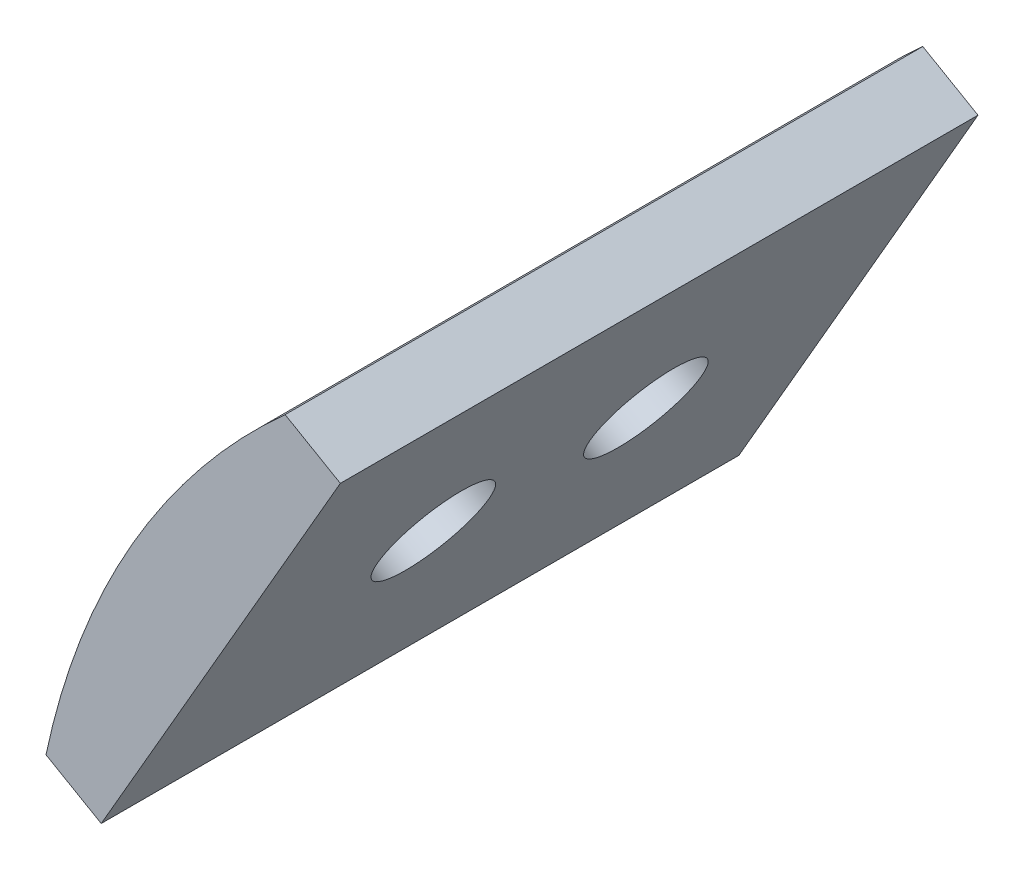
ISO-10303-21;
HEADER;
FILE_DESCRIPTION(('STEP AP214'),'2;1');
FILE_NAME('part.step','',(''),(''),'','','');
FILE_SCHEMA(('AUTOMOTIVE_DESIGN { 1 0 10303 214 1 1 1 1 }'));
ENDSEC;
DATA;
#1=APPLICATION_CONTEXT('core data for automotive mechanical design processes');
#2=APPLICATION_PROTOCOL_DEFINITION('international standard','automotive_design',2000,#1);
#3=PRODUCT_CONTEXT('',#1,'mechanical');
#4=PRODUCT('Part','Part','',(#3));
#5=PRODUCT_RELATED_PRODUCT_CATEGORY('part','',(#4));
#6=PRODUCT_DEFINITION_FORMATION('','',#4);
#7=PRODUCT_DEFINITION_CONTEXT('part definition',#1,'design');
#8=PRODUCT_DEFINITION('design','',#6,#7);
#9=PRODUCT_DEFINITION_SHAPE('','',#8);
#10=(LENGTH_UNIT() NAMED_UNIT(*) SI_UNIT(.MILLI.,.METRE.));
#11=(NAMED_UNIT(*) PLANE_ANGLE_UNIT() SI_UNIT($,.RADIAN.));
#12=(NAMED_UNIT(*) SI_UNIT($,.STERADIAN.) SOLID_ANGLE_UNIT());
#13=UNCERTAINTY_MEASURE_WITH_UNIT(LENGTH_MEASURE(1.E-05),#10,'distance_accuracy_value','');
#14=(GEOMETRIC_REPRESENTATION_CONTEXT(3) GLOBAL_UNCERTAINTY_ASSIGNED_CONTEXT((#13)) GLOBAL_UNIT_ASSIGNED_CONTEXT((#10,
#11,#12)) REPRESENTATION_CONTEXT('',''));
#15=CARTESIAN_POINT('',(0.,0.,0.));
#16=DIRECTION('',(0.,0.,1.));
#17=DIRECTION('',(1.,0.,0.));
#18=AXIS2_PLACEMENT_3D('',#15,#16,#17);
#19=CARTESIAN_POINT('',(-3.89294919243116,2.24759526419166,13.3333333333333));
#20=DIRECTION('',(-0.86602540378444,0.499999999999998,0.));
#21=DIRECTION('',(-0.499999999999998,-0.86602540378444,0.));
#22=AXIS2_PLACEMENT_3D('',#19,#20,#21);
#23=CYLINDRICAL_SURFACE('',#22,1.75);
#24=CARTESIAN_POINT('',(-10.2934059234245,5.94290068076721,13.3333333333333));
#25=DIRECTION('',(-0.866025403784439,0.499999999999998,0.));
#26=DIRECTION('',(-0.499999999999999,-0.86602540378444,0.));
#27=AXIS2_PLACEMENT_3D('',#24,#25,#26);
#28=CIRCLE('',#27,1.75);
#29=CARTESIAN_POINT('',(-11.1684059234245,4.42735622414444,13.3333333333333));
#30=VERTEX_POINT('',#29);
#31=EDGE_CURVE('E56',#30,#30,#28,.T.);
#32=ORIENTED_EDGE('',*,*,#31,.T.);
#33=EDGE_LOOP('',(#32));
#34=FACE_BOUND('',#33,.T.);
#35=CARTESIAN_POINT('',(-9.51794919243115,5.49519052838327,13.3333333333333));
#36=DIRECTION('',(0.86602540378444,-0.499999999999998,0.));
#37=DIRECTION('',(0.499999999999998,0.86602540378444,0.));
#38=AXIS2_PLACEMENT_3D('',#35,#36,#37);
#39=CIRCLE('',#38,1.75);
#40=CARTESIAN_POINT('',(-8.64294919243116,7.01073498500604,13.3333333333333));
#41=VERTEX_POINT('',#40);
#42=EDGE_CURVE('E225',#41,#41,#39,.T.);
#43=ORIENTED_EDGE('',*,*,#42,.T.);
#44=EDGE_LOOP('',(#43));
#45=FACE_BOUND('',#44,.T.);
#46=ADVANCED_FACE('F45',(#34,#45),#23,.F.);
#47=CARTESIAN_POINT('',(-3.89294919243116,2.24759526419166,6.66666666666667));
#48=DIRECTION('',(-0.86602540378444,0.499999999999998,0.));
#49=DIRECTION('',(-0.499999999999998,-0.86602540378444,0.));
#50=AXIS2_PLACEMENT_3D('',#47,#48,#49);
#51=CYLINDRICAL_SURFACE('',#50,1.75);
#52=CARTESIAN_POINT('',(-10.2934059234245,5.94290068076721,6.66666666666667));
#53=DIRECTION('',(-0.866025403784439,0.499999999999998,0.));
#54=DIRECTION('',(-0.499999999999999,-0.86602540378444,0.));
#55=AXIS2_PLACEMENT_3D('',#52,#53,#54);
#56=CIRCLE('',#55,1.75);
#57=CARTESIAN_POINT('',(-11.1684059234245,4.42735622414444,6.66666666666667));
#58=VERTEX_POINT('',#57);
#59=EDGE_CURVE('E212',#58,#58,#56,.T.);
#60=ORIENTED_EDGE('',*,*,#59,.T.);
#61=EDGE_LOOP('',(#60));
#62=FACE_BOUND('',#61,.T.);
#63=CARTESIAN_POINT('',(-9.51794919243115,5.49519052838327,6.66666666666667));
#64=DIRECTION('',(0.86602540378444,-0.499999999999998,0.));
#65=DIRECTION('',(0.499999999999998,0.86602540378444,0.));
#66=AXIS2_PLACEMENT_3D('',#63,#64,#65);
#67=CIRCLE('',#66,1.75);
#68=CARTESIAN_POINT('',(-8.64294919243116,7.01073498500604,6.66666666666667));
#69=VERTEX_POINT('',#68);
#70=EDGE_CURVE('E125',#69,#69,#67,.T.);
#71=ORIENTED_EDGE('',*,*,#70,.T.);
#72=EDGE_LOOP('',(#71));
#73=FACE_BOUND('',#72,.T.);
#74=ADVANCED_FACE('F164',(#62,#73),#51,.F.);
#75=CARTESIAN_POINT('',(-9.51794919243115,5.49519052838327,20.));
#76=DIRECTION('',(0.86602540378444,-0.499999999999998,0.));
#77=DIRECTION('',(0.499999999999998,0.86602540378444,0.));
#78=AXIS2_PLACEMENT_3D('',#75,#76,#77);
#79=PLANE('',#78);
#80=ORIENTED_EDGE('',*,*,#70,.F.);
#81=EDGE_LOOP('',(#80));
#82=FACE_BOUND('',#81,.T.);
#83=ORIENTED_EDGE('',*,*,#42,.F.);
#84=EDGE_LOOP('',(#83));
#85=FACE_BOUND('',#84,.T.);
#86=DIRECTION('',(-0.499999999999998,-0.86602540378444,0.));
#87=VECTOR('',#86,1.);
#88=CARTESIAN_POINT('',(-9.51794919243115,5.49519052838327,0.));
#89=LINE('',#88,#87);
#90=CARTESIAN_POINT('',(-5.76794919243117,11.9903810567666,0.));
#91=VERTEX_POINT('',#90);
#92=CARTESIAN_POINT('',(-13.2679491924311,-1.00000000000003,0.));
#93=VERTEX_POINT('',#92);
#94=EDGE_CURVE('E121',#91,#93,#89,.T.);
#95=ORIENTED_EDGE('',*,*,#94,.F.);
#96=DIRECTION('',(0.,0.,-1.));
#97=VECTOR('',#96,1.);
#98=CARTESIAN_POINT('',(-5.76794919243117,11.9903810567666,20.));
#99=LINE('',#98,#97);
#100=CARTESIAN_POINT('',(-5.76794919243117,11.9903810567666,20.));
#101=VERTEX_POINT('',#100);
#102=EDGE_CURVE('E91',#101,#91,#99,.T.);
#103=ORIENTED_EDGE('',*,*,#102,.F.);
#104=DIRECTION('',(-0.499999999999998,-0.86602540378444,0.));
#105=VECTOR('',#104,1.);
#106=CARTESIAN_POINT('',(-9.51794919243115,5.49519052838327,20.));
#107=LINE('',#106,#105);
#108=CARTESIAN_POINT('',(-13.2679491924311,-1.00000000000003,20.));
#109=VERTEX_POINT('',#108);
#110=EDGE_CURVE('E111',#101,#109,#107,.T.);
#111=ORIENTED_EDGE('',*,*,#110,.T.);
#112=DIRECTION('',(0.,0.,-1.));
#113=VECTOR('',#112,1.);
#114=CARTESIAN_POINT('',(-13.2679491924311,-1.00000000000003,20.));
#115=LINE('',#114,#113);
#116=EDGE_CURVE('E87',#109,#93,#115,.T.);
#117=ORIENTED_EDGE('',*,*,#116,.T.);
#118=EDGE_LOOP('',(#95,#103,#111,#117));
#119=FACE_BOUND('',#118,.T.);
#120=ADVANCED_FACE('F167',(#82,#85,#119),#79,.T.);
#121=CARTESIAN_POINT('',(3.74999999999998,6.4951905283833,20.));
#122=DIRECTION('',(0.499999999999998,0.86602540378444,0.));
#123=DIRECTION('',(-0.86602540378444,0.499999999999998,0.));
#124=AXIS2_PLACEMENT_3D('',#121,#122,#123);
#125=PLANE('',#124);
#126=DIRECTION('',(0.86602540378444,-0.499999999999998,0.));
#127=VECTOR('',#126,1.);
#128=CARTESIAN_POINT('',(3.74999999999998,6.4951905283833,0.));
#129=LINE('',#128,#127);
#130=CARTESIAN_POINT('',(-7.50000000000003,12.9903810567666,0.));
#131=VERTEX_POINT('',#130);
#132=EDGE_CURVE('E102',#131,#91,#129,.T.);
#133=ORIENTED_EDGE('',*,*,#132,.F.);
#134=DIRECTION('',(0.,0.,-1.));
#135=VECTOR('',#134,1.);
#136=CARTESIAN_POINT('',(-7.50000000000003,12.9903810567666,20.));
#137=LINE('',#136,#135);
#138=CARTESIAN_POINT('',(-7.50000000000003,12.9903810567666,20.));
#139=VERTEX_POINT('',#138);
#140=EDGE_CURVE('E96',#139,#131,#137,.T.);
#141=ORIENTED_EDGE('',*,*,#140,.F.);
#142=DIRECTION('',(0.86602540378444,-0.499999999999998,0.));
#143=VECTOR('',#142,1.);
#144=CARTESIAN_POINT('',(3.74999999999998,6.4951905283833,20.));
#145=LINE('',#144,#143);
#146=EDGE_CURVE('E100',#139,#101,#145,.T.);
#147=ORIENTED_EDGE('',*,*,#146,.T.);
#148=ORIENTED_EDGE('',*,*,#102,.T.);
#149=EDGE_LOOP('',(#133,#141,#147,#148));
#150=FACE_BOUND('',#149,.T.);
#151=ADVANCED_FACE('F98',(#150),#125,.T.);
#152=CARTESIAN_POINT('',(8.60759851417086,-4.96959931923274,20.));
#153=DIRECTION('',(0.,0.,-1.));
#154=DIRECTION('',(-1.,0.,0.));
#155=AXIS2_PLACEMENT_3D('',#152,#153,#154);
#156=CYLINDRICAL_SURFACE('',#155,24.125);
#157=CARTESIAN_POINT('',(-13.6814026384312,4.26165480029525,6.66666666666667));
#158=CARTESIAN_POINT('',(-13.6814011898634,4.2616625636811,6.49054081563197));
#159=CARTESIAN_POINT('',(-13.6756948611773,4.2754737448831,6.31430650552282));
#160=CARTESIAN_POINT('',(-13.6528812568409,4.33026692134406,5.96674720754657));
#161=CARTESIAN_POINT('',(-13.6357622320381,4.37127691703728,5.79542746891054));
#162=CARTESIAN_POINT('',(-13.5902196398792,4.47899271755043,5.46277945663156));
#163=CARTESIAN_POINT('',(-13.5618039521739,4.54568061050003,5.30144430899487));
#164=CARTESIAN_POINT('',(-13.4938560812736,4.70245290091844,4.99316826730949));
#165=CARTESIAN_POINT('',(-13.4543257212691,4.79253346099583,4.84622501781758));
#166=CARTESIAN_POINT('',(-13.3642267477219,4.99366790111791,4.56997980385164));
#167=CARTESIAN_POINT('',(-13.3135991994011,5.10483331674645,4.44077825907237));
#168=CARTESIAN_POINT('',(-13.2019851881915,5.34423076556062,4.20455203725541));
#169=CARTESIAN_POINT('',(-13.1409981993277,5.47246366523369,4.097528486863));
#170=CARTESIAN_POINT('',(-13.0092968016581,5.74245316105982,3.90833368658361));
#171=CARTESIAN_POINT('',(-12.9385480223905,5.88425697343827,3.82625368418077));
#172=CARTESIAN_POINT('',(-12.7887828017487,6.17658533460172,3.68986060118192));
#173=CARTESIAN_POINT('',(-12.7097666941826,6.32710953117623,3.635546400013));
#174=CARTESIAN_POINT('',(-12.5456966541401,6.63141023885644,3.55652773997606));
#175=CARTESIAN_POINT('',(-12.4606797643175,6.78516327839906,3.5316560203433));
#176=CARTESIAN_POINT('',(-12.2864147794038,7.09219925434646,3.51170976882124));
#177=CARTESIAN_POINT('',(-12.1971668652169,7.24548221055258,3.51663396409868));
#178=CARTESIAN_POINT('',(-12.0176042001132,7.54627636535353,3.55600614388485));
#179=CARTESIAN_POINT('',(-11.9272992500149,7.6938170176399,3.59027423178388));
#180=CARTESIAN_POINT('',(-11.7479573309612,7.98013142949676,3.68707999465026));
#181=CARTESIAN_POINT('',(-11.6589203879866,8.11890500963514,3.7496182479981));
#182=CARTESIAN_POINT('',(-11.4848916300488,8.38453028223834,3.90137892800165));
#183=CARTESIAN_POINT('',(-11.3999123905257,8.51134596699643,3.99067876517068));
#184=CARTESIAN_POINT('',(-11.2373514179214,8.74952644715168,4.1933713663697));
#185=CARTESIAN_POINT('',(-11.1597700551413,8.86089046924156,4.30676533551708));
#186=CARTESIAN_POINT('',(-11.0144220269248,9.06635176479771,4.55543383175284));
#187=CARTESIAN_POINT('',(-10.9467328565013,9.16031410000724,4.69086520335763));
#188=CARTESIAN_POINT('',(-10.8246190328219,9.32778934098404,4.97922654600236));
#189=CARTESIAN_POINT('',(-10.7701944282761,9.40130217165664,5.132156581298));
#190=CARTESIAN_POINT('',(-10.6769115285455,9.52624178261232,5.45131764748413));
#191=CARTESIAN_POINT('',(-10.6380608661822,9.57765773405661,5.61755515262933));
#192=CARTESIAN_POINT('',(-10.5777025566268,9.65716938424725,5.9585369471506));
#193=CARTESIAN_POINT('',(-10.5561939945762,9.68526631315861,6.13328078727099));
#194=CARTESIAN_POINT('',(-10.5315989179422,9.71737312151796,6.48493849972843));
#195=CARTESIAN_POINT('',(-10.5283780461365,9.72155867605119,6.66182695156879));
#196=CARTESIAN_POINT('',(-10.5401459085653,9.70621746599561,7.01395844421643));
#197=CARTESIAN_POINT('',(-10.5551342183405,9.68669125413238,7.18920152328168));
#198=CARTESIAN_POINT('',(-10.6025451016896,9.62449234280003,7.53240592856072));
#199=CARTESIAN_POINT('',(-10.6349029167339,9.58190561446143,7.70039181406466));
#200=CARTESIAN_POINT('',(-10.7155787475419,9.47460106725999,8.02508292024653));
#201=CARTESIAN_POINT('',(-10.7638973721394,9.40988240415912,8.18178771032318));
#202=CARTESIAN_POINT('',(-10.8747581091653,9.2593206091397,8.48045872758937));
#203=CARTESIAN_POINT('',(-10.9373804129494,9.17335814556738,8.6223350223487));
#204=CARTESIAN_POINT('',(-11.0741221964764,8.98243450524501,8.88640266966225));
#205=CARTESIAN_POINT('',(-11.1482421650608,8.8774725206686,9.00859318479391));
#206=CARTESIAN_POINT('',(-11.305576591966,8.65024870638465,9.23059472911948));
#207=CARTESIAN_POINT('',(-11.3888449023452,8.52788303512749,9.33026138617623));
#208=CARTESIAN_POINT('',(-11.5609625268653,8.26931518418202,9.50338565972606));
#209=CARTESIAN_POINT('',(-11.6498117197897,8.13311330497597,9.5768438452348));
#210=CARTESIAN_POINT('',(-11.8296662942032,7.85076510337362,9.69522915428013));
#211=CARTESIAN_POINT('',(-11.9206646397955,7.70464890884037,9.74023877580248));
#212=CARTESIAN_POINT('',(-12.1020416625151,7.40605921689714,9.80071741077088));
#213=CARTESIAN_POINT('',(-12.192420370043,7.25358603401145,9.81618788395526));
#214=CARTESIAN_POINT('',(-12.3691393858303,6.94774337184185,9.81712006393172));
#215=CARTESIAN_POINT('',(-12.4555047227684,6.79438898423472,9.80280402236304));
#216=CARTESIAN_POINT('',(-12.622586850048,6.49011232585299,9.74504144697442));
#217=CARTESIAN_POINT('',(-12.7033036469043,6.33919005227344,9.70159494675283));
#218=CARTESIAN_POINT('',(-12.857181268413,6.04432472495523,9.58687647223912));
#219=CARTESIAN_POINT('',(-12.9303452397148,5.90037877811629,9.51561614535232));
#220=CARTESIAN_POINT('',(-13.0677469606894,5.62374325023545,9.34731592189622));
#221=CARTESIAN_POINT('',(-13.1319845652808,5.49105385216137,9.25027560639602));
#222=CARTESIAN_POINT('',(-13.2509659043144,5.24011364524085,9.03235135114303));
#223=CARTESIAN_POINT('',(-13.3056386368114,5.12197259966454,8.911302242471));
#224=CARTESIAN_POINT('',(-13.4042712521837,4.90498718859731,8.64914130088702));
#225=CARTESIAN_POINT('',(-13.4482286007705,4.80614738912893,8.50802473430494));
#226=CARTESIAN_POINT('',(-13.5251687376539,4.63068628816119,8.2090482149976));
#227=CARTESIAN_POINT('',(-13.5581045147965,4.55416033761477,8.05112023381237));
#228=CARTESIAN_POINT('',(-13.6124840317291,4.42659183784347,7.72356871663933));
#229=CARTESIAN_POINT('',(-13.6339401538595,4.37552183506328,7.55395800591903));
#230=CARTESIAN_POINT('',(-13.6602016500607,4.31271807301805,7.26402133768606));
#231=CARTESIAN_POINT('',(-13.6681487974506,4.29360206628603,7.14551696224454));
#232=CARTESIAN_POINT('',(-13.6787497630118,4.26806783641042,6.90691409531841));
#233=CARTESIAN_POINT('',(-13.6814036266105,4.26164950429434,6.78681561752343));
#234=CARTESIAN_POINT('',(-13.6814026384312,4.26165480029525,6.66666666666667));
#235=B_SPLINE_CURVE_WITH_KNOTS('',3,(#157,#158,#159,#160,#161,#162,#163,#164,#165,#166,#167,
#168,#169,#170,#171,#172,#173,#174,#175,#176,#177,#178,#179,#180,#181,#182,#183,#184,#185,#186,
#187,#188,#189,#190,#191,#192,#193,#194,#195,#196,#197,#198,#199,#200,#201,#202,#203,#204,#205,
#206,#207,#208,#209,#210,#211,#212,#213,#214,#215,#216,#217,#218,#219,#220,#221,#222,#223,#224,
#225,#226,#227,#228,#229,#230,#231,#232,#233,#234),.UNSPECIFIED.,.T.,.F.,(4,2,2,2,2,2,2,2,2,2,2,
2,2,2,2,2,2,2,2,2,2,2,2,2,2,2,2,2,2,2,2,2,2,2,2,2,2,2,4),(0.,0.527938582808929,1.05642150930951,
1.58453645324286,2.11256481855016,2.64346847175948,3.1743990883419,3.70724918091273,
4.24007776700787,4.76986463704322,5.29962887560045,5.82616838810359,6.35271867358833,
6.88080700514554,7.40892175634309,7.9409743107427,8.47302881892015,9.00534377024579,
9.53763063819642,10.0660017544852,10.5943605545839,11.1207630249001,11.6471855774444,
12.1766352073851,12.7061073538871,13.2388826610132,13.7716464002787,14.302858002813,
14.8340433537439,15.3612794904133,15.8885150189825,16.4155299972193,16.9425535400977,
17.4733370395145,18.0042459526587,18.5373913565092,19.0699605265449,19.4301110146651,
19.7902584119305),.UNSPECIFIED.);
#236=CARTESIAN_POINT('',(-13.6814026384312,4.26165480029525,6.66666666666667));
#237=VERTEX_POINT('',#236);
#238=EDGE_CURVE('E147',#237,#237,#235,.T.);
#239=ORIENTED_EDGE('',*,*,#238,.T.);
#240=EDGE_LOOP('',(#239));
#241=FACE_BOUND('',#240,.T.);
#242=CARTESIAN_POINT('',(-13.6814026384312,4.26165480029525,13.3333333333333));
#243=CARTESIAN_POINT('',(-13.6814011898634,4.26166256368111,13.1572074822986));
#244=CARTESIAN_POINT('',(-13.6756948611773,4.27547374488311,12.9809731721895));
#245=CARTESIAN_POINT('',(-13.6528812568409,4.33026692134406,12.6334138742132));
#246=CARTESIAN_POINT('',(-13.6357622320381,4.37127691703728,12.4620941355772));
#247=CARTESIAN_POINT('',(-13.5902196398792,4.47899271755043,12.1294461232982));
#248=CARTESIAN_POINT('',(-13.561803952174,4.54568061050004,11.9681109756615));
#249=CARTESIAN_POINT('',(-13.4938560812736,4.70245290091845,11.6598349339762));
#250=CARTESIAN_POINT('',(-13.4543257212691,4.79253346099583,11.5128916844842));
#251=CARTESIAN_POINT('',(-13.3642267477219,4.99366790111791,11.2366464705183));
#252=CARTESIAN_POINT('',(-13.3135991994011,5.10483331674645,11.107444925739));
#253=CARTESIAN_POINT('',(-13.2019851881915,5.34423076556062,10.8712187039221));
#254=CARTESIAN_POINT('',(-13.1409981993277,5.47246366523369,10.7641951535297));
#255=CARTESIAN_POINT('',(-13.009296801658,5.74245316105982,10.5750003532503));
#256=CARTESIAN_POINT('',(-12.9385480223905,5.88425697343827,10.4929203508474));
#257=CARTESIAN_POINT('',(-12.7887828017487,6.17658533460172,10.3565272678486));
#258=CARTESIAN_POINT('',(-12.7097666941826,6.32710953117623,10.3022130666797));
#259=CARTESIAN_POINT('',(-12.5456966541401,6.63141023885644,10.2231944066427));
#260=CARTESIAN_POINT('',(-12.4606797643175,6.78516327839906,10.19832268701));
#261=CARTESIAN_POINT('',(-12.2864147794038,7.09219925434646,10.1783764354879));
#262=CARTESIAN_POINT('',(-12.1971668652168,7.24548221055257,10.1833006307653));
#263=CARTESIAN_POINT('',(-12.0176042001132,7.54627636535353,10.2226728105515));
#264=CARTESIAN_POINT('',(-11.9272992500149,7.6938170176399,10.2569408984506));
#265=CARTESIAN_POINT('',(-11.7479573309612,7.98013142949676,10.3537466613169));
#266=CARTESIAN_POINT('',(-11.6589203879866,8.11890500963514,10.4162849146648));
#267=CARTESIAN_POINT('',(-11.4848916300488,8.38453028223834,10.5680455946683));
#268=CARTESIAN_POINT('',(-11.3999123905257,8.51134596699643,10.6573454318373));
#269=CARTESIAN_POINT('',(-11.2373514179214,8.74952644715168,10.8600380330364));
#270=CARTESIAN_POINT('',(-11.1597700551413,8.86089046924156,10.9734320021838));
#271=CARTESIAN_POINT('',(-11.0144220269248,9.0663517647977,11.2221004984195));
#272=CARTESIAN_POINT('',(-10.9467328565013,9.16031410000724,11.3575318700243));
#273=CARTESIAN_POINT('',(-10.8246190328219,9.32778934098405,11.645893212669));
#274=CARTESIAN_POINT('',(-10.7701944282761,9.40130217165664,11.7988232479647));
#275=CARTESIAN_POINT('',(-10.6769115285455,9.52624178261232,12.1179843141508));
#276=CARTESIAN_POINT('',(-10.6380608661822,9.5776577340566,12.284221819296));
#277=CARTESIAN_POINT('',(-10.5777025566268,9.65716938424725,12.6252036138173));
#278=CARTESIAN_POINT('',(-10.5561939945762,9.68526631315861,12.7999474539377));
#279=CARTESIAN_POINT('',(-10.5315989179422,9.71737312151796,13.1516051663951));
#280=CARTESIAN_POINT('',(-10.5283780461365,9.72155867605119,13.3284936182355));
#281=CARTESIAN_POINT('',(-10.5401459085653,9.70621746599561,13.6806251108831));
#282=CARTESIAN_POINT('',(-10.5551342183405,9.68669125413238,13.8558681899484));
#283=CARTESIAN_POINT('',(-10.6025451016896,9.62449234280002,14.1990725952274));
#284=CARTESIAN_POINT('',(-10.6349029167339,9.58190561446143,14.3670584807313));
#285=CARTESIAN_POINT('',(-10.7155787475419,9.47460106725999,14.6917495869132));
#286=CARTESIAN_POINT('',(-10.7638973721394,9.40988240415912,14.8484543769898));
#287=CARTESIAN_POINT('',(-10.8747581091653,9.2593206091397,15.147125394256));
#288=CARTESIAN_POINT('',(-10.9373804129494,9.17335814556737,15.2890016890154));
#289=CARTESIAN_POINT('',(-11.0741221964764,8.982434505245,15.5530693363289));
#290=CARTESIAN_POINT('',(-11.1482421650608,8.8774725206686,15.6752598514606));
#291=CARTESIAN_POINT('',(-11.305576591966,8.65024870638465,15.8972613957861));
#292=CARTESIAN_POINT('',(-11.3888449023452,8.52788303512749,15.9969280528429));
#293=CARTESIAN_POINT('',(-11.5609625268653,8.26931518418202,16.1700523263927));
#294=CARTESIAN_POINT('',(-11.6498117197897,8.13311330497597,16.2435105119015));
#295=CARTESIAN_POINT('',(-11.8296662942032,7.85076510337361,16.3618958209468));
#296=CARTESIAN_POINT('',(-11.9206646397955,7.70464890884036,16.4069054424691));
#297=CARTESIAN_POINT('',(-12.1020416625151,7.40605921689714,16.4673840774375));
#298=CARTESIAN_POINT('',(-12.192420370043,7.25358603401145,16.4828545506219));
#299=CARTESIAN_POINT('',(-12.3691393858303,6.94774337184185,16.4837867305984));
#300=CARTESIAN_POINT('',(-12.4555047227684,6.79438898423472,16.4694706890297));
#301=CARTESIAN_POINT('',(-12.622586850048,6.49011232585298,16.4117081136411));
#302=CARTESIAN_POINT('',(-12.7033036469043,6.33919005227344,16.3682616134195));
#303=CARTESIAN_POINT('',(-12.857181268413,6.04432472495523,16.2535431389058));
#304=CARTESIAN_POINT('',(-12.9303452397148,5.90037877811628,16.182282812019));
#305=CARTESIAN_POINT('',(-13.0677469606894,5.62374325023545,16.0139825885629));
#306=CARTESIAN_POINT('',(-13.1319845652808,5.49105385216137,15.9169422730627));
#307=CARTESIAN_POINT('',(-13.2509659043144,5.24011364524085,15.6990180178097));
#308=CARTESIAN_POINT('',(-13.3056386368114,5.12197259966454,15.5779689091377));
#309=CARTESIAN_POINT('',(-13.4042712521837,4.90498718859731,15.3158079675537));
#310=CARTESIAN_POINT('',(-13.4482286007705,4.80614738912893,15.1746914009716));
#311=CARTESIAN_POINT('',(-13.5251687376539,4.63068628816119,14.8757148816643));
#312=CARTESIAN_POINT('',(-13.5581045147965,4.55416033761477,14.717786900479));
#313=CARTESIAN_POINT('',(-13.6124840317291,4.42659183784348,14.390235383306));
#314=CARTESIAN_POINT('',(-13.6339401538595,4.37552183506328,14.2206246725857));
#315=CARTESIAN_POINT('',(-13.6602016500607,4.31271807301805,13.9306880043527));
#316=CARTESIAN_POINT('',(-13.6681487974506,4.29360206628603,13.8121836289112));
#317=CARTESIAN_POINT('',(-13.6787497630118,4.26806783641042,13.5735807619851));
#318=CARTESIAN_POINT('',(-13.6814036266105,4.26164950429434,13.4534822841901));
#319=CARTESIAN_POINT('',(-13.6814026384312,4.26165480029525,13.3333333333333));
#320=B_SPLINE_CURVE_WITH_KNOTS('',3,(#242,#243,#244,#245,#246,#247,#248,#249,#250,#251,#252,
#253,#254,#255,#256,#257,#258,#259,#260,#261,#262,#263,#264,#265,#266,#267,#268,#269,#270,#271,
#272,#273,#274,#275,#276,#277,#278,#279,#280,#281,#282,#283,#284,#285,#286,#287,#288,#289,#290,
#291,#292,#293,#294,#295,#296,#297,#298,#299,#300,#301,#302,#303,#304,#305,#306,#307,#308,#309,
#310,#311,#312,#313,#314,#315,#316,#317,#318,#319),.UNSPECIFIED.,.T.,.F.,(4,2,2,2,2,2,2,2,2,2,2,
2,2,2,2,2,2,2,2,2,2,2,2,2,2,2,2,2,2,2,2,2,2,2,2,2,2,2,4),(0.,0.527938582808929,1.05642150930951,
1.58453645324286,2.11256481855016,2.64346847175949,3.1743990883419,3.70724918091273,
4.24007776700786,4.76986463704322,5.29962887560044,5.82616838810359,6.35271867358833,
6.88080700514554,7.40892175634309,7.94097431074269,8.47302881892015,9.00534377024579,
9.53763063819641,10.0660017544852,10.5943605545839,11.1207630249001,11.6471855774443,
12.1766352073851,12.7061073538871,13.2388826610132,13.7716464002787,14.3028580028129,
14.8340433537439,15.3612794904133,15.8885150189825,16.4155299972193,16.9425535400977,
17.4733370395145,18.0042459526587,18.5373913565092,19.0699605265449,19.4301110146651,
19.7902584119305),.UNSPECIFIED.);
#321=CARTESIAN_POINT('',(-13.6814026384312,4.26165480029525,13.3333333333333));
#322=VERTEX_POINT('',#321);
#323=EDGE_CURVE('E138',#322,#322,#320,.T.);
#324=ORIENTED_EDGE('',*,*,#323,.T.);
#325=EDGE_LOOP('',(#324));
#326=FACE_BOUND('',#325,.T.);
#327=CARTESIAN_POINT('',(8.60759851417086,-4.96959931923274,0.));
#328=DIRECTION('',(0.,0.,1.));
#329=DIRECTION('',(1.,0.,0.));
#330=AXIS2_PLACEMENT_3D('',#327,#328,#329);
#331=CIRCLE('',#330,24.125);
#332=CARTESIAN_POINT('',(-15.,0.,0.));
#333=VERTEX_POINT('',#332);
#334=EDGE_CURVE('E80',#131,#333,#331,.T.);
#335=ORIENTED_EDGE('',*,*,#334,.T.);
#336=DIRECTION('',(0.,0.,-1.));
#337=VECTOR('',#336,1.);
#338=CARTESIAN_POINT('',(-15.,0.,20.));
#339=LINE('',#338,#337);
#340=CARTESIAN_POINT('',(-15.,0.,20.));
#341=VERTEX_POINT('',#340);
#342=EDGE_CURVE('E104',#341,#333,#339,.T.);
#343=ORIENTED_EDGE('',*,*,#342,.F.);
#344=CARTESIAN_POINT('',(8.60759851417086,-4.96959931923274,20.));
#345=DIRECTION('',(0.,0.,1.));
#346=DIRECTION('',(1.,0.,0.));
#347=AXIS2_PLACEMENT_3D('',#344,#345,#346);
#348=CIRCLE('',#347,24.125);
#349=EDGE_CURVE('E106',#139,#341,#348,.T.);
#350=ORIENTED_EDGE('',*,*,#349,.F.);
#351=ORIENTED_EDGE('',*,*,#140,.T.);
#352=EDGE_LOOP('',(#335,#343,#350,#351));
#353=FACE_BOUND('',#352,.T.);
#354=ADVANCED_FACE('F107',(#241,#326,#353),#156,.T.);
#355=CARTESIAN_POINT('',(-3.74999999999998,-6.4951905283833,20.));
#356=DIRECTION('',(0.499999999999998,0.86602540378444,0.));
#357=DIRECTION('',(-0.86602540378444,0.499999999999998,0.));
#358=AXIS2_PLACEMENT_3D('',#355,#356,#357);
#359=PLANE('',#358);
#360=DIRECTION('',(0.86602540378444,-0.499999999999998,0.));
#361=VECTOR('',#360,1.);
#362=CARTESIAN_POINT('',(-3.74999999999998,-6.4951905283833,0.));
#363=LINE('',#362,#361);
#364=EDGE_CURVE('E115',#333,#93,#363,.T.);
#365=ORIENTED_EDGE('',*,*,#364,.T.);
#366=ORIENTED_EDGE('',*,*,#116,.F.);
#367=DIRECTION('',(0.86602540378444,-0.499999999999998,0.));
#368=VECTOR('',#367,1.);
#369=CARTESIAN_POINT('',(-3.74999999999998,-6.4951905283833,20.));
#370=LINE('',#369,#368);
#371=EDGE_CURVE('E64',#341,#109,#370,.T.);
#372=ORIENTED_EDGE('',*,*,#371,.F.);
#373=ORIENTED_EDGE('',*,*,#342,.T.);
#374=EDGE_LOOP('',(#365,#366,#372,#373));
#375=FACE_BOUND('',#374,.T.);
#376=ADVANCED_FACE('F175',(#375),#359,.F.);
#377=CARTESIAN_POINT('',(0.,0.,20.));
#378=DIRECTION('',(0.,0.,1.));
#379=DIRECTION('',(1.,0.,0.));
#380=AXIS2_PLACEMENT_3D('',#377,#378,#379);
#381=PLANE('',#380);
#382=ORIENTED_EDGE('',*,*,#110,.F.);
#383=ORIENTED_EDGE('',*,*,#146,.F.);
#384=ORIENTED_EDGE('',*,*,#349,.T.);
#385=ORIENTED_EDGE('',*,*,#371,.T.);
#386=EDGE_LOOP('',(#382,#383,#384,#385));
#387=FACE_BOUND('',#386,.T.);
#388=ADVANCED_FACE('F110',(#387),#381,.T.);
#389=CARTESIAN_POINT('',(0.,0.,0.));
#390=DIRECTION('',(0.,0.,1.));
#391=DIRECTION('',(1.,0.,0.));
#392=AXIS2_PLACEMENT_3D('',#389,#390,#391);
#393=PLANE('',#392);
#394=ORIENTED_EDGE('',*,*,#94,.T.);
#395=ORIENTED_EDGE('',*,*,#364,.F.);
#396=ORIENTED_EDGE('',*,*,#334,.F.);
#397=ORIENTED_EDGE('',*,*,#132,.T.);
#398=EDGE_LOOP('',(#394,#395,#396,#397));
#399=FACE_BOUND('',#398,.T.);
#400=ADVANCED_FACE('F174',(#399),#393,.F.);
#401=CARTESIAN_POINT('',(-11.4192389483443,6.59290068076721,6.66666666666667));
#402=DIRECTION('',(-0.86602540378444,0.499999999999998,0.));
#403=DIRECTION('',(-0.499999999999998,-0.86602540378444,0.));
#404=AXIS2_PLACEMENT_3D('',#401,#402,#403);
#405=CYLINDRICAL_SURFACE('',#404,3.15);
#406=CARTESIAN_POINT('',(-11.4192389483443,6.59290068076721,6.66666666666667));
#407=DIRECTION('',(-0.86602540378444,0.499999999999998,0.));
#408=DIRECTION('',(-0.499999999999998,-0.86602540378444,0.));
#409=AXIS2_PLACEMENT_3D('',#406,#407,#408);
#410=CIRCLE('',#409,3.15);
#411=CARTESIAN_POINT('',(-12.9942389483443,3.86492065884622,6.66666666666667));
#412=VERTEX_POINT('',#411);
#413=EDGE_CURVE('E227',#412,#412,#410,.T.);
#414=ORIENTED_EDGE('',*,*,#413,.F.);
#415=EDGE_LOOP('',(#414));
#416=FACE_BOUND('',#415,.T.);
#417=ORIENTED_EDGE('',*,*,#238,.F.);
#418=EDGE_LOOP('',(#417));
#419=FACE_BOUND('',#418,.T.);
#420=ADVANCED_FACE('F177',(#416,#419),#405,.F.);
#421=CARTESIAN_POINT('',(-11.4192389483443,6.59290068076721,0.));
#422=DIRECTION('',(-0.86602540378444,0.499999999999998,0.));
#423=DIRECTION('',(-0.499999999999998,-0.86602540378444,0.));
#424=AXIS2_PLACEMENT_3D('',#421,#422,#423);
#425=PLANE('',#424);
#426=CARTESIAN_POINT('',(-11.4192389483443,6.59290068076721,6.66666666666667));
#427=DIRECTION('',(-0.86602540378444,0.499999999999998,0.));
#428=DIRECTION('',(-0.499999999999998,-0.86602540378444,0.));
#429=AXIS2_PLACEMENT_3D('',#426,#427,#428);
#430=CIRCLE('',#429,3.05000000000001);
#431=CARTESIAN_POINT('',(-12.9442389483443,3.95152319922466,6.66666666666667));
#432=VERTEX_POINT('',#431);
#433=EDGE_CURVE('E209',#432,#432,#430,.F.);
#434=ORIENTED_EDGE('',*,*,#433,.T.);
#435=EDGE_LOOP('',(#434));
#436=FACE_BOUND('',#435,.T.);
#437=ORIENTED_EDGE('',*,*,#413,.T.);
#438=EDGE_LOOP('',(#437));
#439=FACE_BOUND('',#438,.T.);
#440=ADVANCED_FACE('F162',(#436,#439),#425,.T.);
#441=CARTESIAN_POINT('',(-11.4192389483443,6.59290068076721,13.3333333333333));
#442=DIRECTION('',(-0.86602540378444,0.499999999999998,0.));
#443=DIRECTION('',(-0.499999999999998,-0.86602540378444,0.));
#444=AXIS2_PLACEMENT_3D('',#441,#442,#443);
#445=CYLINDRICAL_SURFACE('',#444,3.15);
#446=CARTESIAN_POINT('',(-11.4192389483443,6.59290068076721,13.3333333333333));
#447=DIRECTION('',(-0.86602540378444,0.499999999999998,0.));
#448=DIRECTION('',(-0.499999999999998,-0.86602540378444,0.));
#449=AXIS2_PLACEMENT_3D('',#446,#447,#448);
#450=CIRCLE('',#449,3.15);
#451=CARTESIAN_POINT('',(-12.9942389483443,3.86492065884623,13.3333333333333));
#452=VERTEX_POINT('',#451);
#453=EDGE_CURVE('E233',#452,#452,#450,.T.);
#454=ORIENTED_EDGE('',*,*,#453,.F.);
#455=EDGE_LOOP('',(#454));
#456=FACE_BOUND('',#455,.T.);
#457=ORIENTED_EDGE('',*,*,#323,.F.);
#458=EDGE_LOOP('',(#457));
#459=FACE_BOUND('',#458,.T.);
#460=ADVANCED_FACE('F156',(#456,#459),#445,.F.);
#461=CARTESIAN_POINT('',(-11.4192389483443,6.59290068076721,0.));
#462=DIRECTION('',(-0.86602540378444,0.499999999999998,0.));
#463=DIRECTION('',(-0.499999999999998,-0.86602540378444,0.));
#464=AXIS2_PLACEMENT_3D('',#461,#462,#463);
#465=PLANE('',#464);
#466=CARTESIAN_POINT('',(-11.4192389483443,6.59290068076721,13.3333333333333));
#467=DIRECTION('',(-0.86602540378444,0.499999999999998,0.));
#468=DIRECTION('',(-0.499999999999998,-0.86602540378444,0.));
#469=AXIS2_PLACEMENT_3D('',#466,#467,#468);
#470=CIRCLE('',#469,3.05000000000001);
#471=CARTESIAN_POINT('',(-12.9442389483443,3.95152319922466,13.3333333333333));
#472=VERTEX_POINT('',#471);
#473=EDGE_CURVE('E11',#472,#472,#470,.F.);
#474=ORIENTED_EDGE('',*,*,#473,.T.);
#475=EDGE_LOOP('',(#474));
#476=FACE_BOUND('',#475,.T.);
#477=ORIENTED_EDGE('',*,*,#453,.T.);
#478=EDGE_LOOP('',(#477));
#479=FACE_BOUND('',#478,.T.);
#480=ADVANCED_FACE('F161',(#476,#479),#465,.T.);
#481=CARTESIAN_POINT('',(-10.2934059234245,5.94290068076721,6.66666666666667));
#482=DIRECTION('',(-0.866025403784439,0.499999999999998,0.));
#483=DIRECTION('',(-0.499999999999999,-0.86602540378444,0.));
#484=AXIS2_PLACEMENT_3D('',#481,#482,#483);
#485=CONICAL_SURFACE('',#484,1.75,0.785398163397451);
#486=ORIENTED_EDGE('',*,*,#433,.F.);
#487=EDGE_LOOP('',(#486));
#488=FACE_BOUND('',#487,.T.);
#489=ORIENTED_EDGE('',*,*,#59,.F.);
#490=EDGE_LOOP('',(#489));
#491=FACE_BOUND('',#490,.T.);
#492=ADVANCED_FACE('F195',(#488,#491),#485,.F.);
#493=CARTESIAN_POINT('',(-10.2934059234245,5.94290068076721,13.3333333333333));
#494=DIRECTION('',(-0.866025403784439,0.499999999999998,0.));
#495=DIRECTION('',(-0.499999999999999,-0.86602540378444,0.));
#496=AXIS2_PLACEMENT_3D('',#493,#494,#495);
#497=CONICAL_SURFACE('',#496,1.75,0.785398163397451);
#498=ORIENTED_EDGE('',*,*,#473,.F.);
#499=EDGE_LOOP('',(#498));
#500=FACE_BOUND('',#499,.T.);
#501=ORIENTED_EDGE('',*,*,#31,.F.);
#502=EDGE_LOOP('',(#501));
#503=FACE_BOUND('',#502,.T.);
#504=ADVANCED_FACE('F48',(#500,#503),#497,.F.);
#505=CLOSED_SHELL('',(#46,#74,#120,#151,#354,#376,#388,#400,#420,#440,#460,#480,#492,#504));
#506=MANIFOLD_SOLID_BREP('B2',#505);
#507=ADVANCED_BREP_SHAPE_REPRESENTATION('',(#18,#506),#14);
#508=SHAPE_DEFINITION_REPRESENTATION(#9,#507);
ENDSEC;
END-ISO-10303-21;
